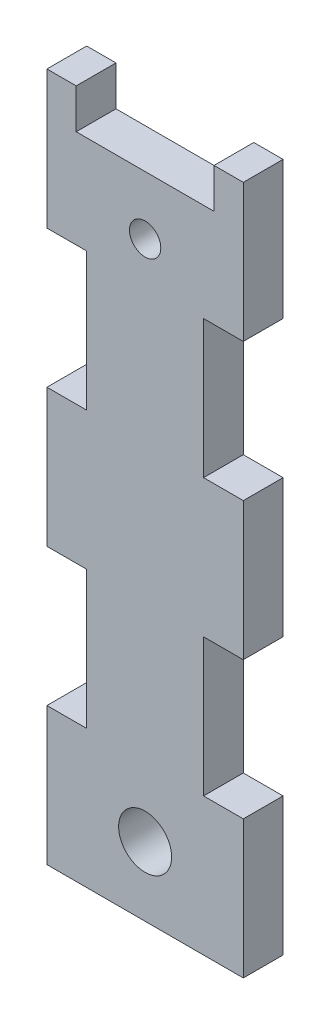
ISO-10303-21;
HEADER;
FILE_DESCRIPTION(('STEP AP214'),'2;1');
FILE_NAME('part.step','',(''),(''),'','','');
FILE_SCHEMA(('AUTOMOTIVE_DESIGN { 1 0 10303 214 1 1 1 1 }'));
ENDSEC;
DATA;
#1=APPLICATION_CONTEXT('core data for automotive mechanical design processes');
#2=APPLICATION_PROTOCOL_DEFINITION('international standard','automotive_design',2000,#1);
#3=PRODUCT_CONTEXT('',#1,'mechanical');
#4=PRODUCT('Part','Part','',(#3));
#5=PRODUCT_RELATED_PRODUCT_CATEGORY('part','',(#4));
#6=PRODUCT_DEFINITION_FORMATION('','',#4);
#7=PRODUCT_DEFINITION_CONTEXT('part definition',#1,'design');
#8=PRODUCT_DEFINITION('design','',#6,#7);
#9=PRODUCT_DEFINITION_SHAPE('','',#8);
#10=(LENGTH_UNIT() NAMED_UNIT(*) SI_UNIT(.MILLI.,.METRE.));
#11=(NAMED_UNIT(*) PLANE_ANGLE_UNIT() SI_UNIT($,.RADIAN.));
#12=(NAMED_UNIT(*) SI_UNIT($,.STERADIAN.) SOLID_ANGLE_UNIT());
#13=UNCERTAINTY_MEASURE_WITH_UNIT(LENGTH_MEASURE(1.E-05),#10,'distance_accuracy_value','');
#14=(GEOMETRIC_REPRESENTATION_CONTEXT(3) GLOBAL_UNCERTAINTY_ASSIGNED_CONTEXT((#13)) GLOBAL_UNIT_ASSIGNED_CONTEXT((#10,
#11,#12)) REPRESENTATION_CONTEXT('',''));
#15=CARTESIAN_POINT('',(0.,0.,0.));
#16=DIRECTION('',(0.,0.,1.));
#17=DIRECTION('',(1.,0.,0.));
#18=AXIS2_PLACEMENT_3D('',#15,#16,#17);
#19=CARTESIAN_POINT('',(0.,-33.02,9.525));
#20=DIRECTION('',(0.,1.,0.));
#21=DIRECTION('',(0.,0.,1.));
#22=AXIS2_PLACEMENT_3D('',#19,#20,#21);
#23=PLANE('',#22);
#24=DIRECTION('',(1.,0.,0.));
#25=VECTOR('',#24,1.);
#26=CARTESIAN_POINT('',(0.,-33.02,0.));
#27=LINE('',#26,#25);
#28=CARTESIAN_POINT('',(0.,-33.02,0.));
#29=VERTEX_POINT('',#28);
#30=CARTESIAN_POINT('',(9.525,-33.02,0.));
#31=VERTEX_POINT('',#30);
#32=EDGE_CURVE('E240',#29,#31,#27,.T.);
#33=ORIENTED_EDGE('',*,*,#32,.T.);
#34=DIRECTION('',(0.,0.,-1.));
#35=VECTOR('',#34,1.);
#36=CARTESIAN_POINT('',(9.525,-33.02,9.525));
#37=LINE('',#36,#35);
#38=CARTESIAN_POINT('',(9.525,-33.02,9.525));
#39=VERTEX_POINT('',#38);
#40=EDGE_CURVE('E11',#39,#31,#37,.T.);
#41=ORIENTED_EDGE('',*,*,#40,.F.);
#42=DIRECTION('',(1.,0.,0.));
#43=VECTOR('',#42,1.);
#44=CARTESIAN_POINT('',(0.,-33.02,9.525));
#45=LINE('',#44,#43);
#46=CARTESIAN_POINT('',(0.,-33.02,9.525));
#47=VERTEX_POINT('',#46);
#48=EDGE_CURVE('E315',#47,#39,#45,.T.);
#49=ORIENTED_EDGE('',*,*,#48,.F.);
#50=DIRECTION('',(0.,0.,-1.));
#51=VECTOR('',#50,1.);
#52=CARTESIAN_POINT('',(0.,-33.02,9.525));
#53=LINE('',#52,#51);
#54=EDGE_CURVE('E239',#47,#29,#53,.T.);
#55=ORIENTED_EDGE('',*,*,#54,.T.);
#56=EDGE_LOOP('',(#33,#41,#49,#55));
#57=FACE_BOUND('',#56,.T.);
#58=ADVANCED_FACE('F38',(#57),#23,.F.);
#59=CARTESIAN_POINT('',(9.52500000000001,0.,9.525));
#60=DIRECTION('',(1.,0.,0.));
#61=DIRECTION('',(0.,1.,0.));
#62=AXIS2_PLACEMENT_3D('',#59,#60,#61);
#63=PLANE('',#62);
#64=DIRECTION('',(0.,-1.,0.));
#65=VECTOR('',#64,1.);
#66=CARTESIAN_POINT('',(9.52500000000001,0.,0.));
#67=LINE('',#66,#65);
#68=CARTESIAN_POINT('',(9.52499999999999,-66.04,0.));
#69=VERTEX_POINT('',#68);
#70=EDGE_CURVE('E244',#31,#69,#67,.T.);
#71=ORIENTED_EDGE('',*,*,#70,.T.);
#72=DIRECTION('',(0.,0.,-1.));
#73=VECTOR('',#72,1.);
#74=CARTESIAN_POINT('',(9.52499999999999,-66.04,9.525));
#75=LINE('',#74,#73);
#76=CARTESIAN_POINT('',(9.52499999999999,-66.04,9.525));
#77=VERTEX_POINT('',#76);
#78=EDGE_CURVE('E47',#77,#69,#75,.T.);
#79=ORIENTED_EDGE('',*,*,#78,.F.);
#80=DIRECTION('',(0.,-1.,0.));
#81=VECTOR('',#80,1.);
#82=CARTESIAN_POINT('',(9.52500000000001,0.,9.525));
#83=LINE('',#82,#81);
#84=EDGE_CURVE('E146',#39,#77,#83,.T.);
#85=ORIENTED_EDGE('',*,*,#84,.F.);
#86=ORIENTED_EDGE('',*,*,#40,.T.);
#87=EDGE_LOOP('',(#71,#79,#85,#86));
#88=FACE_BOUND('',#87,.T.);
#89=ADVANCED_FACE('F495',(#88),#63,.F.);
#90=CARTESIAN_POINT('',(0.,-66.04,9.525));
#91=DIRECTION('',(0.,-1.,0.));
#92=DIRECTION('',(0.,0.,-1.));
#93=AXIS2_PLACEMENT_3D('',#90,#91,#92);
#94=PLANE('',#93);
#95=DIRECTION('',(-1.,0.,0.));
#96=VECTOR('',#95,1.);
#97=CARTESIAN_POINT('',(0.,-66.04,0.));
#98=LINE('',#97,#96);
#99=CARTESIAN_POINT('',(0.,-66.04,0.));
#100=VERTEX_POINT('',#99);
#101=EDGE_CURVE('E248',#69,#100,#98,.T.);
#102=ORIENTED_EDGE('',*,*,#101,.T.);
#103=DIRECTION('',(0.,0.,-1.));
#104=VECTOR('',#103,1.);
#105=CARTESIAN_POINT('',(0.,-66.04,9.525));
#106=LINE('',#105,#104);
#107=CARTESIAN_POINT('',(0.,-66.04,9.525));
#108=VERTEX_POINT('',#107);
#109=EDGE_CURVE('E390',#108,#100,#106,.T.);
#110=ORIENTED_EDGE('',*,*,#109,.F.);
#111=DIRECTION('',(-1.,0.,0.));
#112=VECTOR('',#111,1.);
#113=CARTESIAN_POINT('',(0.,-66.04,9.525));
#114=LINE('',#113,#112);
#115=EDGE_CURVE('E400',#77,#108,#114,.T.);
#116=ORIENTED_EDGE('',*,*,#115,.F.);
#117=ORIENTED_EDGE('',*,*,#78,.T.);
#118=EDGE_LOOP('',(#102,#110,#116,#117));
#119=FACE_BOUND('',#118,.T.);
#120=ADVANCED_FACE('F398',(#119),#94,.F.);
#121=CARTESIAN_POINT('',(0.,0.,9.525));
#122=DIRECTION('',(1.,0.,0.));
#123=DIRECTION('',(0.,1.,0.));
#124=AXIS2_PLACEMENT_3D('',#121,#122,#123);
#125=PLANE('',#124);
#126=DIRECTION('',(0.,-1.,0.));
#127=VECTOR('',#126,1.);
#128=CARTESIAN_POINT('',(0.,0.,0.));
#129=LINE('',#128,#127);
#130=CARTESIAN_POINT('',(0.,-99.06,0.));
#131=VERTEX_POINT('',#130);
#132=EDGE_CURVE('E251',#100,#131,#129,.T.);
#133=ORIENTED_EDGE('',*,*,#132,.T.);
#134=DIRECTION('',(0.,0.,-1.));
#135=VECTOR('',#134,1.);
#136=CARTESIAN_POINT('',(0.,-99.06,9.525));
#137=LINE('',#136,#135);
#138=CARTESIAN_POINT('',(0.,-99.06,9.525));
#139=VERTEX_POINT('',#138);
#140=EDGE_CURVE('E386',#139,#131,#137,.T.);
#141=ORIENTED_EDGE('',*,*,#140,.F.);
#142=DIRECTION('',(0.,-1.,0.));
#143=VECTOR('',#142,1.);
#144=CARTESIAN_POINT('',(0.,0.,9.525));
#145=LINE('',#144,#143);
#146=EDGE_CURVE('E420',#108,#139,#145,.T.);
#147=ORIENTED_EDGE('',*,*,#146,.F.);
#148=ORIENTED_EDGE('',*,*,#109,.T.);
#149=EDGE_LOOP('',(#133,#141,#147,#148));
#150=FACE_BOUND('',#149,.T.);
#151=ADVANCED_FACE('F410',(#150),#125,.F.);
#152=CARTESIAN_POINT('',(0.,-99.06,9.525));
#153=DIRECTION('',(0.,1.,0.));
#154=DIRECTION('',(0.,0.,1.));
#155=AXIS2_PLACEMENT_3D('',#152,#153,#154);
#156=PLANE('',#155);
#157=DIRECTION('',(1.,0.,0.));
#158=VECTOR('',#157,1.);
#159=CARTESIAN_POINT('',(0.,-99.06,0.));
#160=LINE('',#159,#158);
#161=CARTESIAN_POINT('',(9.52499999999999,-99.06,0.));
#162=VERTEX_POINT('',#161);
#163=EDGE_CURVE('E254',#131,#162,#160,.T.);
#164=ORIENTED_EDGE('',*,*,#163,.T.);
#165=DIRECTION('',(0.,0.,-1.));
#166=VECTOR('',#165,1.);
#167=CARTESIAN_POINT('',(9.52499999999999,-99.06,9.525));
#168=LINE('',#167,#166);
#169=CARTESIAN_POINT('',(9.52499999999999,-99.06,9.525));
#170=VERTEX_POINT('',#169);
#171=EDGE_CURVE('E382',#170,#162,#168,.T.);
#172=ORIENTED_EDGE('',*,*,#171,.F.);
#173=DIRECTION('',(1.,0.,0.));
#174=VECTOR('',#173,1.);
#175=CARTESIAN_POINT('',(0.,-99.06,9.525));
#176=LINE('',#175,#174);
#177=EDGE_CURVE('E416',#139,#170,#176,.T.);
#178=ORIENTED_EDGE('',*,*,#177,.F.);
#179=ORIENTED_EDGE('',*,*,#140,.T.);
#180=EDGE_LOOP('',(#164,#172,#178,#179));
#181=FACE_BOUND('',#180,.T.);
#182=ADVANCED_FACE('F414',(#181),#156,.F.);
#183=CARTESIAN_POINT('',(9.52500000000001,0.,9.525));
#184=DIRECTION('',(1.,0.,0.));
#185=DIRECTION('',(0.,1.,0.));
#186=AXIS2_PLACEMENT_3D('',#183,#184,#185);
#187=PLANE('',#186);
#188=DIRECTION('',(0.,-1.,0.));
#189=VECTOR('',#188,1.);
#190=CARTESIAN_POINT('',(9.52500000000001,0.,0.));
#191=LINE('',#190,#189);
#192=CARTESIAN_POINT('',(9.52499999999998,-132.08,0.));
#193=VERTEX_POINT('',#192);
#194=EDGE_CURVE('E257',#162,#193,#191,.T.);
#195=ORIENTED_EDGE('',*,*,#194,.T.);
#196=DIRECTION('',(0.,0.,-1.));
#197=VECTOR('',#196,1.);
#198=CARTESIAN_POINT('',(9.52499999999998,-132.08,9.525));
#199=LINE('',#198,#197);
#200=CARTESIAN_POINT('',(9.52499999999998,-132.08,9.525));
#201=VERTEX_POINT('',#200);
#202=EDGE_CURVE('E378',#201,#193,#199,.T.);
#203=ORIENTED_EDGE('',*,*,#202,.F.);
#204=DIRECTION('',(0.,-1.,0.));
#205=VECTOR('',#204,1.);
#206=CARTESIAN_POINT('',(9.52500000000001,0.,9.525));
#207=LINE('',#206,#205);
#208=EDGE_CURVE('E419',#170,#201,#207,.T.);
#209=ORIENTED_EDGE('',*,*,#208,.F.);
#210=ORIENTED_EDGE('',*,*,#171,.T.);
#211=EDGE_LOOP('',(#195,#203,#209,#210));
#212=FACE_BOUND('',#211,.T.);
#213=ADVANCED_FACE('F508',(#212),#187,.F.);
#214=CARTESIAN_POINT('',(0.,-132.08,9.525));
#215=DIRECTION('',(0.,-1.,0.));
#216=DIRECTION('',(0.,0.,-1.));
#217=AXIS2_PLACEMENT_3D('',#214,#215,#216);
#218=PLANE('',#217);
#219=DIRECTION('',(-1.,0.,0.));
#220=VECTOR('',#219,1.);
#221=CARTESIAN_POINT('',(0.,-132.08,0.));
#222=LINE('',#221,#220);
#223=CARTESIAN_POINT('',(0.,-132.08,0.));
#224=VERTEX_POINT('',#223);
#225=EDGE_CURVE('E260',#193,#224,#222,.T.);
#226=ORIENTED_EDGE('',*,*,#225,.T.);
#227=DIRECTION('',(0.,0.,-1.));
#228=VECTOR('',#227,1.);
#229=CARTESIAN_POINT('',(0.,-132.08,9.525));
#230=LINE('',#229,#228);
#231=CARTESIAN_POINT('',(0.,-132.08,9.525));
#232=VERTEX_POINT('',#231);
#233=EDGE_CURVE('E374',#232,#224,#230,.T.);
#234=ORIENTED_EDGE('',*,*,#233,.F.);
#235=DIRECTION('',(-1.,0.,0.));
#236=VECTOR('',#235,1.);
#237=CARTESIAN_POINT('',(0.,-132.08,9.525));
#238=LINE('',#237,#236);
#239=EDGE_CURVE('E424',#201,#232,#238,.T.);
#240=ORIENTED_EDGE('',*,*,#239,.F.);
#241=ORIENTED_EDGE('',*,*,#202,.T.);
#242=EDGE_LOOP('',(#226,#234,#240,#241));
#243=FACE_BOUND('',#242,.T.);
#244=ADVANCED_FACE('F511',(#243),#218,.F.);
#245=CARTESIAN_POINT('',(0.,0.,9.525));
#246=DIRECTION('',(1.,0.,0.));
#247=DIRECTION('',(0.,1.,0.));
#248=AXIS2_PLACEMENT_3D('',#245,#246,#247);
#249=PLANE('',#248);
#250=DIRECTION('',(0.,-1.,0.));
#251=VECTOR('',#250,1.);
#252=CARTESIAN_POINT('',(0.,0.,0.));
#253=LINE('',#252,#251);
#254=CARTESIAN_POINT('',(0.,-165.1,0.));
#255=VERTEX_POINT('',#254);
#256=EDGE_CURVE('E263',#224,#255,#253,.T.);
#257=ORIENTED_EDGE('',*,*,#256,.T.);
#258=DIRECTION('',(0.,0.,-1.));
#259=VECTOR('',#258,1.);
#260=CARTESIAN_POINT('',(0.,-165.1,9.525));
#261=LINE('',#260,#259);
#262=CARTESIAN_POINT('',(0.,-165.1,9.525));
#263=VERTEX_POINT('',#262);
#264=EDGE_CURVE('E370',#263,#255,#261,.T.);
#265=ORIENTED_EDGE('',*,*,#264,.F.);
#266=DIRECTION('',(0.,-1.,0.));
#267=VECTOR('',#266,1.);
#268=CARTESIAN_POINT('',(0.,0.,9.525));
#269=LINE('',#268,#267);
#270=EDGE_CURVE('E431',#232,#263,#269,.T.);
#271=ORIENTED_EDGE('',*,*,#270,.F.);
#272=ORIENTED_EDGE('',*,*,#233,.T.);
#273=EDGE_LOOP('',(#257,#265,#271,#272));
#274=FACE_BOUND('',#273,.T.);
#275=ADVANCED_FACE('F515',(#274),#249,.F.);
#276=CARTESIAN_POINT('',(0.,-165.1,9.525));
#277=DIRECTION('',(0.,1.,0.));
#278=DIRECTION('',(-1.,0.,0.));
#279=AXIS2_PLACEMENT_3D('',#276,#277,#278);
#280=PLANE('',#279);
#281=DIRECTION('',(1.,0.,0.));
#282=VECTOR('',#281,1.);
#283=CARTESIAN_POINT('',(0.,-165.1,0.));
#284=LINE('',#283,#282);
#285=CARTESIAN_POINT('',(47.05000012,-165.1,0.));
#286=VERTEX_POINT('',#285);
#287=EDGE_CURVE('E266',#255,#286,#284,.T.);
#288=ORIENTED_EDGE('',*,*,#287,.T.);
#289=DIRECTION('',(0.,0.,-1.));
#290=VECTOR('',#289,1.);
#291=CARTESIAN_POINT('',(47.05000012,-165.1,9.525));
#292=LINE('',#291,#290);
#293=CARTESIAN_POINT('',(47.05000012,-165.1,9.525));
#294=VERTEX_POINT('',#293);
#295=EDGE_CURVE('E366',#294,#286,#292,.T.);
#296=ORIENTED_EDGE('',*,*,#295,.F.);
#297=DIRECTION('',(1.,0.,0.));
#298=VECTOR('',#297,1.);
#299=CARTESIAN_POINT('',(0.,-165.1,9.525));
#300=LINE('',#299,#298);
#301=EDGE_CURVE('E434',#263,#294,#300,.T.);
#302=ORIENTED_EDGE('',*,*,#301,.F.);
#303=ORIENTED_EDGE('',*,*,#264,.T.);
#304=EDGE_LOOP('',(#288,#296,#302,#303));
#305=FACE_BOUND('',#304,.T.);
#306=ADVANCED_FACE('F519',(#305),#280,.F.);
#307=CARTESIAN_POINT('',(47.05000012,0.,9.525));
#308=DIRECTION('',(-1.,0.,0.));
#309=DIRECTION('',(0.,0.,1.));
#310=AXIS2_PLACEMENT_3D('',#307,#308,#309);
#311=PLANE('',#310);
#312=DIRECTION('',(0.,1.,0.));
#313=VECTOR('',#312,1.);
#314=CARTESIAN_POINT('',(47.05000012,0.,0.));
#315=LINE('',#314,#313);
#316=CARTESIAN_POINT('',(47.05000012,-132.08,0.));
#317=VERTEX_POINT('',#316);
#318=EDGE_CURVE('E269',#286,#317,#315,.T.);
#319=ORIENTED_EDGE('',*,*,#318,.T.);
#320=DIRECTION('',(0.,0.,-1.));
#321=VECTOR('',#320,1.);
#322=CARTESIAN_POINT('',(47.05000012,-132.08,9.525));
#323=LINE('',#322,#321);
#324=CARTESIAN_POINT('',(47.05000012,-132.08,9.525));
#325=VERTEX_POINT('',#324);
#326=EDGE_CURVE('E362',#325,#317,#323,.T.);
#327=ORIENTED_EDGE('',*,*,#326,.F.);
#328=DIRECTION('',(0.,1.,0.));
#329=VECTOR('',#328,1.);
#330=CARTESIAN_POINT('',(47.05000012,0.,9.525));
#331=LINE('',#330,#329);
#332=EDGE_CURVE('E437',#294,#325,#331,.T.);
#333=ORIENTED_EDGE('',*,*,#332,.F.);
#334=ORIENTED_EDGE('',*,*,#295,.T.);
#335=EDGE_LOOP('',(#319,#327,#333,#334));
#336=FACE_BOUND('',#335,.T.);
#337=ADVANCED_FACE('F523',(#336),#311,.F.);
#338=CARTESIAN_POINT('',(-3.84877315203387E-13,-132.08,9.525));
#339=DIRECTION('',(0.,-1.,0.));
#340=DIRECTION('',(1.,0.,0.));
#341=AXIS2_PLACEMENT_3D('',#338,#339,#340);
#342=PLANE('',#341);
#343=DIRECTION('',(-1.,0.,0.));
#344=VECTOR('',#343,1.);
#345=CARTESIAN_POINT('',(-3.84877315203387E-13,-132.08,0.));
#346=LINE('',#345,#344);
#347=CARTESIAN_POINT('',(37.52500012,-132.08,0.));
#348=VERTEX_POINT('',#347);
#349=EDGE_CURVE('E272',#317,#348,#346,.T.);
#350=ORIENTED_EDGE('',*,*,#349,.T.);
#351=DIRECTION('',(0.,0.,-1.));
#352=VECTOR('',#351,1.);
#353=CARTESIAN_POINT('',(37.52500012,-132.08,9.525));
#354=LINE('',#353,#352);
#355=CARTESIAN_POINT('',(37.52500012,-132.08,9.525));
#356=VERTEX_POINT('',#355);
#357=EDGE_CURVE('E358',#356,#348,#354,.T.);
#358=ORIENTED_EDGE('',*,*,#357,.F.);
#359=DIRECTION('',(-1.,0.,0.));
#360=VECTOR('',#359,1.);
#361=CARTESIAN_POINT('',(-3.84877315203387E-13,-132.08,9.525));
#362=LINE('',#361,#360);
#363=EDGE_CURVE('E440',#325,#356,#362,.T.);
#364=ORIENTED_EDGE('',*,*,#363,.F.);
#365=ORIENTED_EDGE('',*,*,#326,.T.);
#366=EDGE_LOOP('',(#350,#358,#364,#365));
#367=FACE_BOUND('',#366,.T.);
#368=ADVANCED_FACE('F527',(#367),#342,.F.);
#369=CARTESIAN_POINT('',(37.52500012,0.,9.525));
#370=DIRECTION('',(-1.,0.,0.));
#371=DIRECTION('',(0.,0.,1.));
#372=AXIS2_PLACEMENT_3D('',#369,#370,#371);
#373=PLANE('',#372);
#374=DIRECTION('',(0.,1.,0.));
#375=VECTOR('',#374,1.);
#376=CARTESIAN_POINT('',(37.52500012,0.,0.));
#377=LINE('',#376,#375);
#378=CARTESIAN_POINT('',(37.52500012,-99.06,0.));
#379=VERTEX_POINT('',#378);
#380=EDGE_CURVE('E275',#348,#379,#377,.T.);
#381=ORIENTED_EDGE('',*,*,#380,.T.);
#382=DIRECTION('',(0.,0.,-1.));
#383=VECTOR('',#382,1.);
#384=CARTESIAN_POINT('',(37.52500012,-99.06,9.525));
#385=LINE('',#384,#383);
#386=CARTESIAN_POINT('',(37.52500012,-99.06,9.525));
#387=VERTEX_POINT('',#386);
#388=EDGE_CURVE('E354',#387,#379,#385,.T.);
#389=ORIENTED_EDGE('',*,*,#388,.F.);
#390=DIRECTION('',(0.,1.,0.));
#391=VECTOR('',#390,1.);
#392=CARTESIAN_POINT('',(37.52500012,0.,9.525));
#393=LINE('',#392,#391);
#394=EDGE_CURVE('E443',#356,#387,#393,.T.);
#395=ORIENTED_EDGE('',*,*,#394,.F.);
#396=ORIENTED_EDGE('',*,*,#357,.T.);
#397=EDGE_LOOP('',(#381,#389,#395,#396));
#398=FACE_BOUND('',#397,.T.);
#399=ADVANCED_FACE('F531',(#398),#373,.F.);
#400=CARTESIAN_POINT('',(0.,-99.06,9.525));
#401=DIRECTION('',(0.,1.,0.));
#402=DIRECTION('',(0.,0.,1.));
#403=AXIS2_PLACEMENT_3D('',#400,#401,#402);
#404=PLANE('',#403);
#405=DIRECTION('',(1.,0.,0.));
#406=VECTOR('',#405,1.);
#407=CARTESIAN_POINT('',(0.,-99.06,0.));
#408=LINE('',#407,#406);
#409=CARTESIAN_POINT('',(47.05000012,-99.06,0.));
#410=VERTEX_POINT('',#409);
#411=EDGE_CURVE('E278',#379,#410,#408,.T.);
#412=ORIENTED_EDGE('',*,*,#411,.T.);
#413=DIRECTION('',(0.,0.,-1.));
#414=VECTOR('',#413,1.);
#415=CARTESIAN_POINT('',(47.05000012,-99.06,9.525));
#416=LINE('',#415,#414);
#417=CARTESIAN_POINT('',(47.05000012,-99.06,9.525));
#418=VERTEX_POINT('',#417);
#419=EDGE_CURVE('E350',#418,#410,#416,.T.);
#420=ORIENTED_EDGE('',*,*,#419,.F.);
#421=DIRECTION('',(1.,0.,0.));
#422=VECTOR('',#421,1.);
#423=CARTESIAN_POINT('',(0.,-99.06,9.525));
#424=LINE('',#423,#422);
#425=EDGE_CURVE('E446',#387,#418,#424,.T.);
#426=ORIENTED_EDGE('',*,*,#425,.F.);
#427=ORIENTED_EDGE('',*,*,#388,.T.);
#428=EDGE_LOOP('',(#412,#420,#426,#427));
#429=FACE_BOUND('',#428,.T.);
#430=ADVANCED_FACE('F535',(#429),#404,.F.);
#431=CARTESIAN_POINT('',(47.05000012,0.,9.525));
#432=DIRECTION('',(-1.,0.,0.));
#433=DIRECTION('',(0.,-1.,0.));
#434=AXIS2_PLACEMENT_3D('',#431,#432,#433);
#435=PLANE('',#434);
#436=DIRECTION('',(0.,1.,0.));
#437=VECTOR('',#436,1.);
#438=CARTESIAN_POINT('',(47.05000012,0.,0.));
#439=LINE('',#438,#437);
#440=CARTESIAN_POINT('',(47.05000012,-66.04,0.));
#441=VERTEX_POINT('',#440);
#442=EDGE_CURVE('E281',#410,#441,#439,.T.);
#443=ORIENTED_EDGE('',*,*,#442,.T.);
#444=DIRECTION('',(0.,0.,-1.));
#445=VECTOR('',#444,1.);
#446=CARTESIAN_POINT('',(47.05000012,-66.04,9.525));
#447=LINE('',#446,#445);
#448=CARTESIAN_POINT('',(47.05000012,-66.04,9.525));
#449=VERTEX_POINT('',#448);
#450=EDGE_CURVE('E346',#449,#441,#447,.T.);
#451=ORIENTED_EDGE('',*,*,#450,.F.);
#452=DIRECTION('',(0.,1.,0.));
#453=VECTOR('',#452,1.);
#454=CARTESIAN_POINT('',(47.05000012,0.,9.525));
#455=LINE('',#454,#453);
#456=EDGE_CURVE('E449',#418,#449,#455,.T.);
#457=ORIENTED_EDGE('',*,*,#456,.F.);
#458=ORIENTED_EDGE('',*,*,#419,.T.);
#459=EDGE_LOOP('',(#443,#451,#457,#458));
#460=FACE_BOUND('',#459,.T.);
#461=ADVANCED_FACE('F539',(#460),#435,.F.);
#462=CARTESIAN_POINT('',(0.,-66.04,9.525));
#463=DIRECTION('',(0.,-1.,0.));
#464=DIRECTION('',(0.,0.,-1.));
#465=AXIS2_PLACEMENT_3D('',#462,#463,#464);
#466=PLANE('',#465);
#467=DIRECTION('',(-1.,0.,0.));
#468=VECTOR('',#467,1.);
#469=CARTESIAN_POINT('',(0.,-66.04,0.));
#470=LINE('',#469,#468);
#471=CARTESIAN_POINT('',(37.52500012,-66.04,0.));
#472=VERTEX_POINT('',#471);
#473=EDGE_CURVE('E284',#441,#472,#470,.T.);
#474=ORIENTED_EDGE('',*,*,#473,.T.);
#475=DIRECTION('',(0.,0.,-1.));
#476=VECTOR('',#475,1.);
#477=CARTESIAN_POINT('',(37.52500012,-66.04,9.525));
#478=LINE('',#477,#476);
#479=CARTESIAN_POINT('',(37.52500012,-66.04,9.525));
#480=VERTEX_POINT('',#479);
#481=EDGE_CURVE('E342',#480,#472,#478,.T.);
#482=ORIENTED_EDGE('',*,*,#481,.F.);
#483=DIRECTION('',(-1.,0.,0.));
#484=VECTOR('',#483,1.);
#485=CARTESIAN_POINT('',(0.,-66.04,9.525));
#486=LINE('',#485,#484);
#487=EDGE_CURVE('E452',#449,#480,#486,.T.);
#488=ORIENTED_EDGE('',*,*,#487,.F.);
#489=ORIENTED_EDGE('',*,*,#450,.T.);
#490=EDGE_LOOP('',(#474,#482,#488,#489));
#491=FACE_BOUND('',#490,.T.);
#492=ADVANCED_FACE('F543',(#491),#466,.F.);
#493=CARTESIAN_POINT('',(37.52500012,0.,9.525));
#494=DIRECTION('',(-1.,0.,0.));
#495=DIRECTION('',(0.,0.,1.));
#496=AXIS2_PLACEMENT_3D('',#493,#494,#495);
#497=PLANE('',#496);
#498=DIRECTION('',(0.,1.,0.));
#499=VECTOR('',#498,1.);
#500=CARTESIAN_POINT('',(37.52500012,0.,0.));
#501=LINE('',#500,#499);
#502=CARTESIAN_POINT('',(37.52500012,-33.02,0.));
#503=VERTEX_POINT('',#502);
#504=EDGE_CURVE('E287',#472,#503,#501,.T.);
#505=ORIENTED_EDGE('',*,*,#504,.T.);
#506=DIRECTION('',(0.,0.,-1.));
#507=VECTOR('',#506,1.);
#508=CARTESIAN_POINT('',(37.52500012,-33.02,9.525));
#509=LINE('',#508,#507);
#510=CARTESIAN_POINT('',(37.52500012,-33.02,9.525));
#511=VERTEX_POINT('',#510);
#512=EDGE_CURVE('E338',#511,#503,#509,.T.);
#513=ORIENTED_EDGE('',*,*,#512,.F.);
#514=DIRECTION('',(0.,1.,0.));
#515=VECTOR('',#514,1.);
#516=CARTESIAN_POINT('',(37.52500012,0.,9.525));
#517=LINE('',#516,#515);
#518=EDGE_CURVE('E455',#480,#511,#517,.T.);
#519=ORIENTED_EDGE('',*,*,#518,.F.);
#520=ORIENTED_EDGE('',*,*,#481,.T.);
#521=EDGE_LOOP('',(#505,#513,#519,#520));
#522=FACE_BOUND('',#521,.T.);
#523=ADVANCED_FACE('F547',(#522),#497,.F.);
#524=CARTESIAN_POINT('',(0.,-33.02,9.525));
#525=DIRECTION('',(0.,1.,0.));
#526=DIRECTION('',(0.,0.,1.));
#527=AXIS2_PLACEMENT_3D('',#524,#525,#526);
#528=PLANE('',#527);
#529=DIRECTION('',(1.,0.,0.));
#530=VECTOR('',#529,1.);
#531=CARTESIAN_POINT('',(0.,-33.02,0.));
#532=LINE('',#531,#530);
#533=CARTESIAN_POINT('',(47.05000012,-33.02,0.));
#534=VERTEX_POINT('',#533);
#535=EDGE_CURVE('E290',#503,#534,#532,.T.);
#536=ORIENTED_EDGE('',*,*,#535,.T.);
#537=DIRECTION('',(0.,0.,-1.));
#538=VECTOR('',#537,1.);
#539=CARTESIAN_POINT('',(47.05000012,-33.02,9.525));
#540=LINE('',#539,#538);
#541=CARTESIAN_POINT('',(47.05000012,-33.02,9.525));
#542=VERTEX_POINT('',#541);
#543=EDGE_CURVE('E334',#542,#534,#540,.T.);
#544=ORIENTED_EDGE('',*,*,#543,.F.);
#545=DIRECTION('',(1.,0.,0.));
#546=VECTOR('',#545,1.);
#547=CARTESIAN_POINT('',(0.,-33.02,9.525));
#548=LINE('',#547,#546);
#549=EDGE_CURVE('E458',#511,#542,#548,.T.);
#550=ORIENTED_EDGE('',*,*,#549,.F.);
#551=ORIENTED_EDGE('',*,*,#512,.T.);
#552=EDGE_LOOP('',(#536,#544,#550,#551));
#553=FACE_BOUND('',#552,.T.);
#554=ADVANCED_FACE('F551',(#553),#528,.F.);
#555=CARTESIAN_POINT('',(47.05000012,0.,9.525));
#556=DIRECTION('',(-1.,0.,0.));
#557=DIRECTION('',(0.,-1.,0.));
#558=AXIS2_PLACEMENT_3D('',#555,#556,#557);
#559=PLANE('',#558);
#560=DIRECTION('',(0.,1.,0.));
#561=VECTOR('',#560,1.);
#562=CARTESIAN_POINT('',(47.05000012,0.,0.));
#563=LINE('',#562,#561);
#564=CARTESIAN_POINT('',(47.05000012,0.,0.));
#565=VERTEX_POINT('',#564);
#566=EDGE_CURVE('E293',#534,#565,#563,.T.);
#567=ORIENTED_EDGE('',*,*,#566,.T.);
#568=DIRECTION('',(0.,0.,-1.));
#569=VECTOR('',#568,1.);
#570=CARTESIAN_POINT('',(47.05000012,0.,9.525));
#571=LINE('',#570,#569);
#572=CARTESIAN_POINT('',(47.05000012,0.,9.525));
#573=VERTEX_POINT('',#572);
#574=EDGE_CURVE('E330',#573,#565,#571,.T.);
#575=ORIENTED_EDGE('',*,*,#574,.F.);
#576=DIRECTION('',(0.,1.,0.));
#577=VECTOR('',#576,1.);
#578=CARTESIAN_POINT('',(47.05000012,0.,9.525));
#579=LINE('',#578,#577);
#580=EDGE_CURVE('E461',#542,#573,#579,.T.);
#581=ORIENTED_EDGE('',*,*,#580,.F.);
#582=ORIENTED_EDGE('',*,*,#543,.T.);
#583=EDGE_LOOP('',(#567,#575,#581,#582));
#584=FACE_BOUND('',#583,.T.);
#585=ADVANCED_FACE('F555',(#584),#559,.F.);
#586=CARTESIAN_POINT('',(0.,0.,9.525));
#587=DIRECTION('',(0.,-1.,0.));
#588=DIRECTION('',(1.,0.,0.));
#589=AXIS2_PLACEMENT_3D('',#586,#587,#588);
#590=PLANE('',#589);
#591=DIRECTION('',(-1.,0.,0.));
#592=VECTOR('',#591,1.);
#593=CARTESIAN_POINT('',(0.,0.,0.));
#594=LINE('',#593,#592);
#595=CARTESIAN_POINT('',(40.03500006,0.,0.));
#596=VERTEX_POINT('',#595);
#597=EDGE_CURVE('E296',#565,#596,#594,.T.);
#598=ORIENTED_EDGE('',*,*,#597,.T.);
#599=DIRECTION('',(0.,0.,-1.));
#600=VECTOR('',#599,1.);
#601=CARTESIAN_POINT('',(40.03500006,0.,9.525));
#602=LINE('',#601,#600);
#603=CARTESIAN_POINT('',(40.03500006,0.,9.525));
#604=VERTEX_POINT('',#603);
#605=EDGE_CURVE('E326',#604,#596,#602,.T.);
#606=ORIENTED_EDGE('',*,*,#605,.F.);
#607=DIRECTION('',(-1.,0.,0.));
#608=VECTOR('',#607,1.);
#609=CARTESIAN_POINT('',(0.,0.,9.525));
#610=LINE('',#609,#608);
#611=EDGE_CURVE('E464',#573,#604,#610,.T.);
#612=ORIENTED_EDGE('',*,*,#611,.F.);
#613=ORIENTED_EDGE('',*,*,#574,.T.);
#614=EDGE_LOOP('',(#598,#606,#612,#613));
#615=FACE_BOUND('',#614,.T.);
#616=ADVANCED_FACE('F559',(#615),#590,.F.);
#617=CARTESIAN_POINT('',(40.03500006,0.,9.525));
#618=DIRECTION('',(1.,0.,0.));
#619=DIRECTION('',(0.,0.,-1.));
#620=AXIS2_PLACEMENT_3D('',#617,#618,#619);
#621=PLANE('',#620);
#622=DIRECTION('',(0.,-1.,0.));
#623=VECTOR('',#622,1.);
#624=CARTESIAN_POINT('',(40.03500006,0.,0.));
#625=LINE('',#624,#623);
#626=CARTESIAN_POINT('',(40.03500006,-9.52500000000001,0.));
#627=VERTEX_POINT('',#626);
#628=EDGE_CURVE('E299',#596,#627,#625,.T.);
#629=ORIENTED_EDGE('',*,*,#628,.T.);
#630=DIRECTION('',(0.,0.,-1.));
#631=VECTOR('',#630,1.);
#632=CARTESIAN_POINT('',(40.03500006,-9.52500000000001,9.525));
#633=LINE('',#632,#631);
#634=CARTESIAN_POINT('',(40.03500006,-9.52500000000001,9.525));
#635=VERTEX_POINT('',#634);
#636=EDGE_CURVE('E322',#635,#627,#633,.T.);
#637=ORIENTED_EDGE('',*,*,#636,.F.);
#638=DIRECTION('',(0.,-1.,0.));
#639=VECTOR('',#638,1.);
#640=CARTESIAN_POINT('',(40.03500006,0.,9.525));
#641=LINE('',#640,#639);
#642=EDGE_CURVE('E467',#604,#635,#641,.T.);
#643=ORIENTED_EDGE('',*,*,#642,.F.);
#644=ORIENTED_EDGE('',*,*,#605,.T.);
#645=EDGE_LOOP('',(#629,#637,#643,#644));
#646=FACE_BOUND('',#645,.T.);
#647=ADVANCED_FACE('F475',(#646),#621,.F.);
#648=CARTESIAN_POINT('',(0.,-9.52500000000001,9.525));
#649=DIRECTION('',(0.,-1.,0.));
#650=DIRECTION('',(0.,0.,-1.));
#651=AXIS2_PLACEMENT_3D('',#648,#649,#650);
#652=PLANE('',#651);
#653=DIRECTION('',(-1.,0.,0.));
#654=VECTOR('',#653,1.);
#655=CARTESIAN_POINT('',(0.,-9.52500000000001,0.));
#656=LINE('',#655,#654);
#657=CARTESIAN_POINT('',(7.01500006,-9.52500000000001,0.));
#658=VERTEX_POINT('',#657);
#659=EDGE_CURVE('E302',#627,#658,#656,.T.);
#660=ORIENTED_EDGE('',*,*,#659,.T.);
#661=DIRECTION('',(0.,0.,-1.));
#662=VECTOR('',#661,1.);
#663=CARTESIAN_POINT('',(7.01500006,-9.52500000000001,9.525));
#664=LINE('',#663,#662);
#665=CARTESIAN_POINT('',(7.01500006,-9.52500000000001,9.525));
#666=VERTEX_POINT('',#665);
#667=EDGE_CURVE('E225',#666,#658,#664,.T.);
#668=ORIENTED_EDGE('',*,*,#667,.F.);
#669=DIRECTION('',(-1.,0.,0.));
#670=VECTOR('',#669,1.);
#671=CARTESIAN_POINT('',(0.,-9.52500000000001,9.525));
#672=LINE('',#671,#670);
#673=EDGE_CURVE('E214',#635,#666,#672,.T.);
#674=ORIENTED_EDGE('',*,*,#673,.F.);
#675=ORIENTED_EDGE('',*,*,#636,.T.);
#676=EDGE_LOOP('',(#660,#668,#674,#675));
#677=FACE_BOUND('',#676,.T.);
#678=ADVANCED_FACE('F479',(#677),#652,.F.);
#679=CARTESIAN_POINT('',(7.01500006,0.,9.525));
#680=DIRECTION('',(-1.,0.,0.));
#681=DIRECTION('',(0.,0.,1.));
#682=AXIS2_PLACEMENT_3D('',#679,#680,#681);
#683=PLANE('',#682);
#684=DIRECTION('',(0.,1.,0.));
#685=VECTOR('',#684,1.);
#686=CARTESIAN_POINT('',(7.01500006,0.,0.));
#687=LINE('',#686,#685);
#688=CARTESIAN_POINT('',(7.01500006,0.,0.));
#689=VERTEX_POINT('',#688);
#690=EDGE_CURVE('E223',#658,#689,#687,.T.);
#691=ORIENTED_EDGE('',*,*,#690,.T.);
#692=DIRECTION('',(0.,0.,-1.));
#693=VECTOR('',#692,1.);
#694=CARTESIAN_POINT('',(7.01500006,0.,9.525));
#695=LINE('',#694,#693);
#696=CARTESIAN_POINT('',(7.01500006,0.,9.525));
#697=VERTEX_POINT('',#696);
#698=EDGE_CURVE('E220',#697,#689,#695,.T.);
#699=ORIENTED_EDGE('',*,*,#698,.F.);
#700=DIRECTION('',(0.,1.,0.));
#701=VECTOR('',#700,1.);
#702=CARTESIAN_POINT('',(7.01500006,0.,9.525));
#703=LINE('',#702,#701);
#704=EDGE_CURVE('E207',#666,#697,#703,.T.);
#705=ORIENTED_EDGE('',*,*,#704,.F.);
#706=ORIENTED_EDGE('',*,*,#667,.T.);
#707=EDGE_LOOP('',(#691,#699,#705,#706));
#708=FACE_BOUND('',#707,.T.);
#709=ADVANCED_FACE('F221',(#708),#683,.F.);
#710=CARTESIAN_POINT('',(0.,0.,9.525));
#711=DIRECTION('',(0.,-1.,0.));
#712=DIRECTION('',(0.,0.,-1.));
#713=AXIS2_PLACEMENT_3D('',#710,#711,#712);
#714=PLANE('',#713);
#715=DIRECTION('',(-1.,0.,0.));
#716=VECTOR('',#715,1.);
#717=CARTESIAN_POINT('',(0.,0.,0.));
#718=LINE('',#717,#716);
#719=CARTESIAN_POINT('',(0.,0.,0.));
#720=VERTEX_POINT('',#719);
#721=EDGE_CURVE('E132',#689,#720,#718,.T.);
#722=ORIENTED_EDGE('',*,*,#721,.T.);
#723=DIRECTION('',(0.,0.,-1.));
#724=VECTOR('',#723,1.);
#725=CARTESIAN_POINT('',(0.,0.,9.525));
#726=LINE('',#725,#724);
#727=CARTESIAN_POINT('',(0.,0.,9.525));
#728=VERTEX_POINT('',#727);
#729=EDGE_CURVE('E226',#728,#720,#726,.T.);
#730=ORIENTED_EDGE('',*,*,#729,.F.);
#731=DIRECTION('',(-1.,0.,0.));
#732=VECTOR('',#731,1.);
#733=CARTESIAN_POINT('',(0.,0.,9.525));
#734=LINE('',#733,#732);
#735=EDGE_CURVE('E212',#697,#728,#734,.T.);
#736=ORIENTED_EDGE('',*,*,#735,.F.);
#737=ORIENTED_EDGE('',*,*,#698,.T.);
#738=EDGE_LOOP('',(#722,#730,#736,#737));
#739=FACE_BOUND('',#738,.T.);
#740=ADVANCED_FACE('F228',(#739),#714,.F.);
#741=CARTESIAN_POINT('',(0.,0.,9.525));
#742=DIRECTION('',(1.,0.,0.));
#743=DIRECTION('',(0.,1.,0.));
#744=AXIS2_PLACEMENT_3D('',#741,#742,#743);
#745=PLANE('',#744);
#746=DIRECTION('',(0.,-1.,0.));
#747=VECTOR('',#746,1.);
#748=CARTESIAN_POINT('',(0.,0.,0.));
#749=LINE('',#748,#747);
#750=EDGE_CURVE('E138',#720,#29,#749,.T.);
#751=ORIENTED_EDGE('',*,*,#750,.T.);
#752=ORIENTED_EDGE('',*,*,#54,.F.);
#753=DIRECTION('',(0.,-1.,0.));
#754=VECTOR('',#753,1.);
#755=CARTESIAN_POINT('',(0.,0.,9.525));
#756=LINE('',#755,#754);
#757=EDGE_CURVE('E55',#728,#47,#756,.T.);
#758=ORIENTED_EDGE('',*,*,#757,.F.);
#759=ORIENTED_EDGE('',*,*,#729,.T.);
#760=EDGE_LOOP('',(#751,#752,#758,#759));
#761=FACE_BOUND('',#760,.T.);
#762=ADVANCED_FACE('F483',(#761),#745,.F.);
#763=CARTESIAN_POINT('',(23.52500006,-23.525,9.525));
#764=DIRECTION('',(0.,0.,-1.));
#765=DIRECTION('',(-1.,0.,0.));
#766=AXIS2_PLACEMENT_3D('',#763,#764,#765);
#767=CYLINDRICAL_SURFACE('',#766,3.75);
#768=CARTESIAN_POINT('',(23.52500006,-23.525,9.525));
#769=DIRECTION('',(0.,0.,1.));
#770=DIRECTION('',(1.,0.,0.));
#771=AXIS2_PLACEMENT_3D('',#768,#769,#770);
#772=CIRCLE('',#771,3.75);
#773=CARTESIAN_POINT('',(27.27500006,-23.525,9.525));
#774=VERTEX_POINT('',#773);
#775=EDGE_CURVE('E232',#774,#774,#772,.T.);
#776=ORIENTED_EDGE('',*,*,#775,.T.);
#777=EDGE_LOOP('',(#776));
#778=FACE_BOUND('',#777,.T.);
#779=CARTESIAN_POINT('',(23.52500006,-23.525,0.));
#780=DIRECTION('',(0.,0.,1.));
#781=DIRECTION('',(1.,0.,0.));
#782=AXIS2_PLACEMENT_3D('',#779,#780,#781);
#783=CIRCLE('',#782,3.75);
#784=CARTESIAN_POINT('',(27.27500006,-23.525,0.));
#785=VERTEX_POINT('',#784);
#786=EDGE_CURVE('E311',#785,#785,#783,.T.);
#787=ORIENTED_EDGE('',*,*,#786,.F.);
#788=EDGE_LOOP('',(#787));
#789=FACE_BOUND('',#788,.T.);
#790=ADVANCED_FACE('F485',(#778,#789),#767,.F.);
#791=CARTESIAN_POINT('',(0.,0.,9.525));
#792=DIRECTION('',(0.,0.,1.));
#793=DIRECTION('',(1.,0.,0.));
#794=AXIS2_PLACEMENT_3D('',#791,#792,#793);
#795=PLANE('',#794);
#796=CARTESIAN_POINT('',(23.52500006,-148.59,9.525));
#797=DIRECTION('',(0.,0.,1.));
#798=DIRECTION('',(1.,0.,0.));
#799=AXIS2_PLACEMENT_3D('',#796,#797,#798);
#800=CIRCLE('',#799,6.35);
#801=CARTESIAN_POINT('',(29.87500006,-148.59,9.525));
#802=VERTEX_POINT('',#801);
#803=EDGE_CURVE('E642',#802,#802,#800,.T.);
#804=ORIENTED_EDGE('',*,*,#803,.F.);
#805=EDGE_LOOP('',(#804));
#806=FACE_BOUND('',#805,.T.);
#807=ORIENTED_EDGE('',*,*,#48,.T.);
#808=ORIENTED_EDGE('',*,*,#84,.T.);
#809=ORIENTED_EDGE('',*,*,#115,.T.);
#810=ORIENTED_EDGE('',*,*,#146,.T.);
#811=ORIENTED_EDGE('',*,*,#177,.T.);
#812=ORIENTED_EDGE('',*,*,#208,.T.);
#813=ORIENTED_EDGE('',*,*,#239,.T.);
#814=ORIENTED_EDGE('',*,*,#270,.T.);
#815=ORIENTED_EDGE('',*,*,#301,.T.);
#816=ORIENTED_EDGE('',*,*,#332,.T.);
#817=ORIENTED_EDGE('',*,*,#363,.T.);
#818=ORIENTED_EDGE('',*,*,#394,.T.);
#819=ORIENTED_EDGE('',*,*,#425,.T.);
#820=ORIENTED_EDGE('',*,*,#456,.T.);
#821=ORIENTED_EDGE('',*,*,#487,.T.);
#822=ORIENTED_EDGE('',*,*,#518,.T.);
#823=ORIENTED_EDGE('',*,*,#549,.T.);
#824=ORIENTED_EDGE('',*,*,#580,.T.);
#825=ORIENTED_EDGE('',*,*,#611,.T.);
#826=ORIENTED_EDGE('',*,*,#642,.T.);
#827=ORIENTED_EDGE('',*,*,#673,.T.);
#828=ORIENTED_EDGE('',*,*,#704,.T.);
#829=ORIENTED_EDGE('',*,*,#735,.T.);
#830=ORIENTED_EDGE('',*,*,#757,.T.);
#831=EDGE_LOOP('',(#807,#808,#809,#810,#811,#812,#813,#814,#815,#816,#817,#818,#819,#820,#821,
#822,#823,#824,#825,#826,#827,#828,#829,#830));
#832=FACE_BOUND('',#831,.T.);
#833=ORIENTED_EDGE('',*,*,#775,.F.);
#834=EDGE_LOOP('',(#833));
#835=FACE_BOUND('',#834,.T.);
#836=ADVANCED_FACE('F209',(#806,#832,#835),#795,.T.);
#837=CARTESIAN_POINT('',(0.,0.,0.));
#838=DIRECTION('',(0.,0.,1.));
#839=DIRECTION('',(1.,0.,0.));
#840=AXIS2_PLACEMENT_3D('',#837,#838,#839);
#841=PLANE('',#840);
#842=CARTESIAN_POINT('',(23.52500006,-148.59,0.));
#843=DIRECTION('',(0.,0.,1.));
#844=DIRECTION('',(1.,0.,0.));
#845=AXIS2_PLACEMENT_3D('',#842,#843,#844);
#846=CIRCLE('',#845,6.35);
#847=CARTESIAN_POINT('',(29.87500006,-148.59,0.));
#848=VERTEX_POINT('',#847);
#849=EDGE_CURVE('E245',#848,#848,#846,.T.);
#850=ORIENTED_EDGE('',*,*,#849,.T.);
#851=EDGE_LOOP('',(#850));
#852=FACE_BOUND('',#851,.T.);
#853=ORIENTED_EDGE('',*,*,#32,.F.);
#854=ORIENTED_EDGE('',*,*,#750,.F.);
#855=ORIENTED_EDGE('',*,*,#721,.F.);
#856=ORIENTED_EDGE('',*,*,#690,.F.);
#857=ORIENTED_EDGE('',*,*,#659,.F.);
#858=ORIENTED_EDGE('',*,*,#628,.F.);
#859=ORIENTED_EDGE('',*,*,#597,.F.);
#860=ORIENTED_EDGE('',*,*,#566,.F.);
#861=ORIENTED_EDGE('',*,*,#535,.F.);
#862=ORIENTED_EDGE('',*,*,#504,.F.);
#863=ORIENTED_EDGE('',*,*,#473,.F.);
#864=ORIENTED_EDGE('',*,*,#442,.F.);
#865=ORIENTED_EDGE('',*,*,#411,.F.);
#866=ORIENTED_EDGE('',*,*,#380,.F.);
#867=ORIENTED_EDGE('',*,*,#349,.F.);
#868=ORIENTED_EDGE('',*,*,#318,.F.);
#869=ORIENTED_EDGE('',*,*,#287,.F.);
#870=ORIENTED_EDGE('',*,*,#256,.F.);
#871=ORIENTED_EDGE('',*,*,#225,.F.);
#872=ORIENTED_EDGE('',*,*,#194,.F.);
#873=ORIENTED_EDGE('',*,*,#163,.F.);
#874=ORIENTED_EDGE('',*,*,#132,.F.);
#875=ORIENTED_EDGE('',*,*,#101,.F.);
#876=ORIENTED_EDGE('',*,*,#70,.F.);
#877=EDGE_LOOP('',(#853,#854,#855,#856,#857,#858,#859,#860,#861,#862,#863,#864,#865,#866,#867,
#868,#869,#870,#871,#872,#873,#874,#875,#876));
#878=FACE_BOUND('',#877,.T.);
#879=ORIENTED_EDGE('',*,*,#786,.T.);
#880=EDGE_LOOP('',(#879));
#881=FACE_BOUND('',#880,.T.);
#882=ADVANCED_FACE('F404',(#852,#878,#881),#841,.F.);
#883=CARTESIAN_POINT('',(23.52500006,-148.59,0.));
#884=DIRECTION('',(0.,0.,1.));
#885=DIRECTION('',(1.,0.,0.));
#886=AXIS2_PLACEMENT_3D('',#883,#884,#885);
#887=CYLINDRICAL_SURFACE('',#886,6.35);
#888=ORIENTED_EDGE('',*,*,#849,.F.);
#889=EDGE_LOOP('',(#888));
#890=FACE_BOUND('',#889,.T.);
#891=ORIENTED_EDGE('',*,*,#803,.T.);
#892=EDGE_LOOP('',(#891));
#893=FACE_BOUND('',#892,.T.);
#894=ADVANCED_FACE('F603',(#890,#893),#887,.F.);
#895=CLOSED_SHELL('',(#58,#89,#120,#151,#182,#213,#244,#275,#306,#337,#368,#399,#430,#461,#492,
#523,#554,#585,#616,#647,#678,#709,#740,#762,#790,#836,#882,#894));
#896=MANIFOLD_SOLID_BREP('B2',#895);
#897=ADVANCED_BREP_SHAPE_REPRESENTATION('',(#18,#896),#14);
#898=SHAPE_DEFINITION_REPRESENTATION(#9,#897);
ENDSEC;
END-ISO-10303-21;
